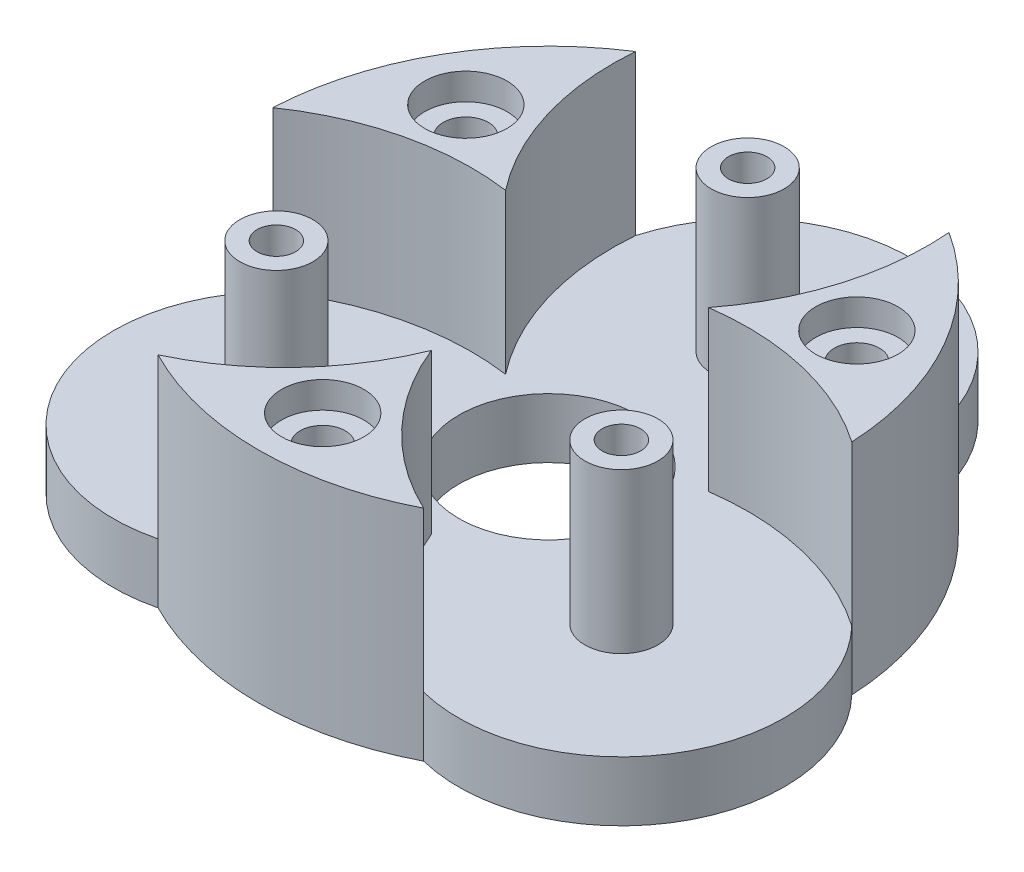
ISO-10303-21;
HEADER;
FILE_DESCRIPTION(('STEP AP214'),'2;1');
FILE_NAME('part.step','',(''),(''),'','','');
FILE_SCHEMA(('AUTOMOTIVE_DESIGN { 1 0 10303 214 1 1 1 1 }'));
ENDSEC;
DATA;
#1=APPLICATION_CONTEXT('core data for automotive mechanical design processes');
#2=APPLICATION_PROTOCOL_DEFINITION('international standard','automotive_design',2000,#1);
#3=PRODUCT_CONTEXT('',#1,'mechanical');
#4=PRODUCT('Part','Part','',(#3));
#5=PRODUCT_RELATED_PRODUCT_CATEGORY('part','',(#4));
#6=PRODUCT_DEFINITION_FORMATION('','',#4);
#7=PRODUCT_DEFINITION_CONTEXT('part definition',#1,'design');
#8=PRODUCT_DEFINITION('design','',#6,#7);
#9=PRODUCT_DEFINITION_SHAPE('','',#8);
#10=(LENGTH_UNIT() NAMED_UNIT(*) SI_UNIT(.MILLI.,.METRE.));
#11=(NAMED_UNIT(*) PLANE_ANGLE_UNIT() SI_UNIT($,.RADIAN.));
#12=(NAMED_UNIT(*) SI_UNIT($,.STERADIAN.) SOLID_ANGLE_UNIT());
#13=UNCERTAINTY_MEASURE_WITH_UNIT(LENGTH_MEASURE(1.E-05),#10,'distance_accuracy_value','');
#14=(GEOMETRIC_REPRESENTATION_CONTEXT(3) GLOBAL_UNCERTAINTY_ASSIGNED_CONTEXT((#13)) GLOBAL_UNIT_ASSIGNED_CONTEXT((#10,
#11,#12)) REPRESENTATION_CONTEXT('',''));
#15=CARTESIAN_POINT('',(0.,0.,0.));
#16=DIRECTION('',(0.,0.,1.));
#17=DIRECTION('',(1.,0.,0.));
#18=AXIS2_PLACEMENT_3D('',#15,#16,#17);
#19=CARTESIAN_POINT('',(-14.7224318643364,-4.80832611206852,-8.49999999999909));
#20=DIRECTION('',(0.,1.,0.));
#21=DIRECTION('',(0.,0.,1.));
#22=AXIS2_PLACEMENT_3D('',#19,#20,#21);
#23=CYLINDRICAL_SURFACE('',#22,1.7);
#24=CARTESIAN_POINT('',(-14.7224318643364,0.,-8.49999999999909));
#25=DIRECTION('',(0.,1.,0.));
#26=DIRECTION('',(0.,0.,1.));
#27=AXIS2_PLACEMENT_3D('',#24,#25,#26);
#28=CIRCLE('',#27,1.7);
#29=CARTESIAN_POINT('',(-14.7224318643364,0.,-6.79999999999909));
#30=VERTEX_POINT('',#29);
#31=EDGE_CURVE('E221',#30,#30,#28,.F.);
#32=ORIENTED_EDGE('',*,*,#31,.T.);
#33=EDGE_LOOP('',(#32));
#34=FACE_BOUND('',#33,.T.);
#35=CARTESIAN_POINT('',(-14.7224318643364,14.5,-8.49999999999909));
#36=DIRECTION('',(0.,1.,0.));
#37=DIRECTION('',(0.,0.,1.));
#38=AXIS2_PLACEMENT_3D('',#35,#36,#37);
#39=CIRCLE('',#38,1.7);
#40=CARTESIAN_POINT('',(-14.7224318643364,14.5,-6.79999999999909));
#41=VERTEX_POINT('',#40);
#42=EDGE_CURVE('E36',#41,#41,#39,.F.);
#43=ORIENTED_EDGE('',*,*,#42,.F.);
#44=EDGE_LOOP('',(#43));
#45=FACE_BOUND('',#44,.T.);
#46=ADVANCED_FACE('F32',(#34,#45),#23,.F.);
#47=CARTESIAN_POINT('',(14.7224318643351,-4.80832611206852,-8.50000000000133));
#48=DIRECTION('',(0.,1.,0.));
#49=DIRECTION('',(0.,0.,1.));
#50=AXIS2_PLACEMENT_3D('',#47,#48,#49);
#51=CYLINDRICAL_SURFACE('',#50,1.7);
#52=CARTESIAN_POINT('',(14.7224318643351,0.,-8.50000000000133));
#53=DIRECTION('',(0.,1.,0.));
#54=DIRECTION('',(0.,0.,1.));
#55=AXIS2_PLACEMENT_3D('',#52,#53,#54);
#56=CIRCLE('',#55,1.7);
#57=CARTESIAN_POINT('',(14.7224318643351,0.,-6.80000000000134));
#58=VERTEX_POINT('',#57);
#59=EDGE_CURVE('E179',#58,#58,#56,.F.);
#60=ORIENTED_EDGE('',*,*,#59,.T.);
#61=EDGE_LOOP('',(#60));
#62=FACE_BOUND('',#61,.T.);
#63=CARTESIAN_POINT('',(14.7224318643351,14.5,-8.50000000000133));
#64=DIRECTION('',(0.,1.,0.));
#65=DIRECTION('',(0.,0.,1.));
#66=AXIS2_PLACEMENT_3D('',#63,#64,#65);
#67=CIRCLE('',#66,1.7);
#68=CARTESIAN_POINT('',(14.7224318643351,14.5,-6.80000000000134));
#69=VERTEX_POINT('',#68);
#70=EDGE_CURVE('E285',#69,#69,#67,.F.);
#71=ORIENTED_EDGE('',*,*,#70,.F.);
#72=EDGE_LOOP('',(#71));
#73=FACE_BOUND('',#72,.T.);
#74=ADVANCED_FACE('F397',(#62,#73),#51,.F.);
#75=CARTESIAN_POINT('',(1.29150162786473E-12,-4.80832611206852,17.0000000000004));
#76=DIRECTION('',(0.,1.,0.));
#77=DIRECTION('',(0.,0.,1.));
#78=AXIS2_PLACEMENT_3D('',#75,#76,#77);
#79=CYLINDRICAL_SURFACE('',#78,1.7);
#80=CARTESIAN_POINT('',(1.29150162786473E-12,0.,17.0000000000004));
#81=DIRECTION('',(0.,1.,0.));
#82=DIRECTION('',(0.,0.,1.));
#83=AXIS2_PLACEMENT_3D('',#80,#81,#82);
#84=CIRCLE('',#83,1.7);
#85=CARTESIAN_POINT('',(1.29150162786473E-12,0.,18.7000000000004));
#86=VERTEX_POINT('',#85);
#87=EDGE_CURVE('E180',#86,#86,#84,.F.);
#88=ORIENTED_EDGE('',*,*,#87,.T.);
#89=EDGE_LOOP('',(#88));
#90=FACE_BOUND('',#89,.T.);
#91=CARTESIAN_POINT('',(1.29150162786473E-12,14.5,17.0000000000004));
#92=DIRECTION('',(0.,1.,0.));
#93=DIRECTION('',(0.,0.,1.));
#94=AXIS2_PLACEMENT_3D('',#91,#92,#93);
#95=CIRCLE('',#94,1.7);
#96=CARTESIAN_POINT('',(1.29150162786473E-12,14.5,18.7000000000004));
#97=VERTEX_POINT('',#96);
#98=EDGE_CURVE('E283',#97,#97,#95,.F.);
#99=ORIENTED_EDGE('',*,*,#98,.F.);
#100=EDGE_LOOP('',(#99));
#101=FACE_BOUND('',#100,.T.);
#102=ADVANCED_FACE('F403',(#90,#101),#79,.F.);
#103=CARTESIAN_POINT('',(0.,16.5,-15.));
#104=DIRECTION('',(0.,1.,0.));
#105=DIRECTION('',(0.,0.,1.));
#106=AXIS2_PLACEMENT_3D('',#103,#104,#105);
#107=CYLINDRICAL_SURFACE('',#106,1.45);
#108=CARTESIAN_POINT('',(0.,16.5,-15.));
#109=DIRECTION('',(0.,1.,0.));
#110=DIRECTION('',(0.,0.,1.));
#111=AXIS2_PLACEMENT_3D('',#108,#109,#110);
#112=CIRCLE('',#111,1.45);
#113=CARTESIAN_POINT('',(0.,16.5,-13.55));
#114=VERTEX_POINT('',#113);
#115=EDGE_CURVE('E176',#114,#114,#112,.T.);
#116=ORIENTED_EDGE('',*,*,#115,.T.);
#117=EDGE_LOOP('',(#116));
#118=FACE_BOUND('',#117,.T.);
#119=CARTESIAN_POINT('',(0.,2.2,-15.));
#120=DIRECTION('',(0.,-1.,0.));
#121=DIRECTION('',(0.,0.,-1.));
#122=AXIS2_PLACEMENT_3D('',#119,#120,#121);
#123=CIRCLE('',#122,1.45);
#124=CARTESIAN_POINT('',(0.,2.2,-16.45));
#125=VERTEX_POINT('',#124);
#126=EDGE_CURVE('E141',#125,#125,#123,.F.);
#127=ORIENTED_EDGE('',*,*,#126,.F.);
#128=EDGE_LOOP('',(#127));
#129=FACE_BOUND('',#128,.T.);
#130=ADVANCED_FACE('F477',(#118,#129),#107,.F.);
#131=CARTESIAN_POINT('',(-12.9903810567659,16.5,7.50000000000037));
#132=DIRECTION('',(0.,1.,0.));
#133=DIRECTION('',(0.,0.,1.));
#134=AXIS2_PLACEMENT_3D('',#131,#132,#133);
#135=CYLINDRICAL_SURFACE('',#134,1.45);
#136=CARTESIAN_POINT('',(-12.9903810567659,16.5,7.50000000000037));
#137=DIRECTION('',(0.,1.,0.));
#138=DIRECTION('',(0.,0.,1.));
#139=AXIS2_PLACEMENT_3D('',#136,#137,#138);
#140=CIRCLE('',#139,1.45);
#141=CARTESIAN_POINT('',(-12.9903810567659,16.5,8.95000000000037));
#142=VERTEX_POINT('',#141);
#143=EDGE_CURVE('E173',#142,#142,#140,.T.);
#144=ORIENTED_EDGE('',*,*,#143,.T.);
#145=EDGE_LOOP('',(#144));
#146=FACE_BOUND('',#145,.T.);
#147=CARTESIAN_POINT('',(-12.9903810567659,2.2,7.50000000000037));
#148=DIRECTION('',(0.,-1.,0.));
#149=DIRECTION('',(0.,0.,-1.));
#150=AXIS2_PLACEMENT_3D('',#147,#148,#149);
#151=CIRCLE('',#150,1.45);
#152=CARTESIAN_POINT('',(-12.9903810567659,2.2,6.05000000000038));
#153=VERTEX_POINT('',#152);
#154=EDGE_CURVE('E144',#153,#153,#151,.F.);
#155=ORIENTED_EDGE('',*,*,#154,.F.);
#156=EDGE_LOOP('',(#155));
#157=FACE_BOUND('',#156,.T.);
#158=ADVANCED_FACE('F532',(#146,#157),#135,.F.);
#159=CARTESIAN_POINT('',(12.9903810567672,16.5,7.49999999999963));
#160=DIRECTION('',(0.,1.,0.));
#161=DIRECTION('',(0.,0.,1.));
#162=AXIS2_PLACEMENT_3D('',#159,#160,#161);
#163=CYLINDRICAL_SURFACE('',#162,1.45);
#164=CARTESIAN_POINT('',(12.9903810567672,16.5,7.49999999999963));
#165=DIRECTION('',(0.,1.,0.));
#166=DIRECTION('',(0.,0.,1.));
#167=AXIS2_PLACEMENT_3D('',#164,#165,#166);
#168=CIRCLE('',#167,1.45);
#169=CARTESIAN_POINT('',(12.9903810567672,16.5,8.94999999999963));
#170=VERTEX_POINT('',#169);
#171=EDGE_CURVE('E170',#170,#170,#168,.T.);
#172=ORIENTED_EDGE('',*,*,#171,.T.);
#173=EDGE_LOOP('',(#172));
#174=FACE_BOUND('',#173,.T.);
#175=CARTESIAN_POINT('',(12.9903810567672,2.2,7.49999999999963));
#176=DIRECTION('',(0.,-1.,0.));
#177=DIRECTION('',(0.,0.,-1.));
#178=AXIS2_PLACEMENT_3D('',#175,#176,#177);
#179=CIRCLE('',#178,1.45);
#180=CARTESIAN_POINT('',(12.9903810567672,2.2,6.04999999999963));
#181=VERTEX_POINT('',#180);
#182=EDGE_CURVE('E277',#181,#181,#179,.F.);
#183=ORIENTED_EDGE('',*,*,#182,.F.);
#184=EDGE_LOOP('',(#183));
#185=FACE_BOUND('',#184,.T.);
#186=ADVANCED_FACE('F529',(#174,#185),#163,.F.);
#187=CARTESIAN_POINT('',(0.,4.5,0.));
#188=DIRECTION('',(0.,-1.,0.));
#189=DIRECTION('',(0.,0.,-1.));
#190=AXIS2_PLACEMENT_3D('',#187,#188,#189);
#191=CYLINDRICAL_SURFACE('',#190,21.825);
#192=CARTESIAN_POINT('',(0.,0.,0.));
#193=DIRECTION('',(0.,1.,0.));
#194=DIRECTION('',(0.,0.,1.));
#195=AXIS2_PLACEMENT_3D('',#192,#193,#194);
#196=CIRCLE('',#195,21.825);
#197=CARTESIAN_POINT('',(21.8002371635045,0.,-1.03936741095642));
#198=VERTEX_POINT('',#197);
#199=CARTESIAN_POINT('',(11.8002371635036,0.,-18.3598754866439));
#200=VERTEX_POINT('',#199);
#201=EDGE_CURVE('E41',#198,#200,#196,.T.);
#202=ORIENTED_EDGE('',*,*,#201,.T.);
#203=DIRECTION('',(0.,-1.,0.));
#204=VECTOR('',#203,1.);
#205=CARTESIAN_POINT('',(11.8002371635029,29.7261619064555,-18.3598754866443));
#206=LINE('',#205,#204);
#207=CARTESIAN_POINT('',(11.800237163503,4.5,-18.3598754866443));
#208=VERTEX_POINT('',#207);
#209=EDGE_CURVE('E140',#208,#200,#206,.T.);
#210=ORIENTED_EDGE('',*,*,#209,.F.);
#211=DIRECTION('',(0.,-1.,0.));
#212=VECTOR('',#211,1.);
#213=CARTESIAN_POINT('',(11.800237163503,38.8704400804743,-18.3598754866443));
#214=LINE('',#213,#212);
#215=CARTESIAN_POINT('',(11.800237163503,16.5,-18.3598754866443));
#216=VERTEX_POINT('',#215);
#217=EDGE_CURVE('E194',#216,#208,#214,.T.);
#218=ORIENTED_EDGE('',*,*,#217,.F.);
#219=CARTESIAN_POINT('',(0.,16.5,0.));
#220=DIRECTION('',(0.,1.,0.));
#221=DIRECTION('',(0.,0.,1.));
#222=AXIS2_PLACEMENT_3D('',#219,#220,#221);
#223=CIRCLE('',#222,21.825);
#224=CARTESIAN_POINT('',(21.8002371635045,16.5,-1.03936741095635));
#225=VERTEX_POINT('',#224);
#226=EDGE_CURVE('E199',#225,#216,#223,.T.);
#227=ORIENTED_EDGE('',*,*,#226,.F.);
#228=DIRECTION('',(0.,-1.,0.));
#229=VECTOR('',#228,1.);
#230=CARTESIAN_POINT('',(21.8002371635045,38.8704400804743,-1.03936741095636));
#231=LINE('',#230,#229);
#232=CARTESIAN_POINT('',(21.8002371635045,4.5,-1.03936741095635));
#233=VERTEX_POINT('',#232);
#234=EDGE_CURVE('E183',#225,#233,#231,.T.);
#235=ORIENTED_EDGE('',*,*,#234,.T.);
#236=DIRECTION('',(0.,-1.,0.));
#237=VECTOR('',#236,1.);
#238=CARTESIAN_POINT('',(21.8002371635045,30.3041566652598,-1.03936741095642));
#239=LINE('',#238,#237);
#240=EDGE_CURVE('E155',#233,#198,#239,.T.);
#241=ORIENTED_EDGE('',*,*,#240,.T.);
#242=EDGE_LOOP('',(#202,#210,#218,#227,#235,#241));
#243=FACE_BOUND('',#242,.T.);
#244=ADVANCED_FACE('F380',(#243),#191,.T.);
#245=CARTESIAN_POINT('',(-9.99999999999841,0.,19.3992428975987));
#246=VERTEX_POINT('',#245);
#247=CARTESIAN_POINT('',(10.0000000000009,0.,19.3992428975974));
#248=VERTEX_POINT('',#247);
#249=EDGE_CURVE('E11',#246,#248,#196,.T.);
#250=ORIENTED_EDGE('',*,*,#249,.T.);
#251=DIRECTION('',(0.,-1.,0.));
#252=VECTOR('',#251,1.);
#253=CARTESIAN_POINT('',(10.0000000000016,30.3041566652598,19.399242897597));
#254=LINE('',#253,#252);
#255=CARTESIAN_POINT('',(10.0000000000016,4.5,19.399242897597));
#256=VERTEX_POINT('',#255);
#257=EDGE_CURVE('E159',#256,#248,#254,.T.);
#258=ORIENTED_EDGE('',*,*,#257,.F.);
#259=DIRECTION('',(0.,-1.,0.));
#260=VECTOR('',#259,1.);
#261=CARTESIAN_POINT('',(10.0000000000016,40.3537208837531,19.399242897597));
#262=LINE('',#261,#260);
#263=CARTESIAN_POINT('',(10.0000000000016,16.5,19.399242897597));
#264=VERTEX_POINT('',#263);
#265=EDGE_CURVE('E217',#264,#256,#262,.T.);
#266=ORIENTED_EDGE('',*,*,#265,.F.);
#267=CARTESIAN_POINT('',(0.,16.5,0.));
#268=DIRECTION('',(0.,1.,0.));
#269=DIRECTION('',(0.,0.,1.));
#270=AXIS2_PLACEMENT_3D('',#267,#268,#269);
#271=CIRCLE('',#270,21.825);
#272=CARTESIAN_POINT('',(-9.99999999999842,16.5,19.3992428975986));
#273=VERTEX_POINT('',#272);
#274=EDGE_CURVE('E222',#273,#264,#271,.T.);
#275=ORIENTED_EDGE('',*,*,#274,.F.);
#276=DIRECTION('',(0.,-1.,0.));
#277=VECTOR('',#276,1.);
#278=CARTESIAN_POINT('',(-9.99999999999842,40.3537208837531,19.3992428975987));
#279=LINE('',#278,#277);
#280=CARTESIAN_POINT('',(-9.99999999999842,4.5,19.3992428975987));
#281=VERTEX_POINT('',#280);
#282=EDGE_CURVE('E198',#273,#281,#279,.T.);
#283=ORIENTED_EDGE('',*,*,#282,.T.);
#284=DIRECTION('',(0.,-1.,0.));
#285=VECTOR('',#284,1.);
#286=CARTESIAN_POINT('',(-9.99999999999841,30.3041566652593,19.3992428975987));
#287=LINE('',#286,#285);
#288=EDGE_CURVE('E163',#281,#246,#287,.T.);
#289=ORIENTED_EDGE('',*,*,#288,.T.);
#290=EDGE_LOOP('',(#250,#258,#266,#275,#283,#289));
#291=FACE_BOUND('',#290,.T.);
#292=ADVANCED_FACE('F351',(#291),#191,.T.);
#293=CARTESIAN_POINT('',(0.,4.5,0.));
#294=DIRECTION('',(0.,1.,0.));
#295=DIRECTION('',(0.,0.,1.));
#296=AXIS2_PLACEMENT_3D('',#293,#294,#295);
#297=PLANE('',#296);
#298=CARTESIAN_POINT('',(0.,4.5,0.));
#299=DIRECTION('',(0.,1.,0.));
#300=DIRECTION('',(0.,0.,1.));
#301=AXIS2_PLACEMENT_3D('',#298,#299,#300);
#302=CIRCLE('',#301,6.75);
#303=CARTESIAN_POINT('',(0.,4.5,6.75));
#304=VERTEX_POINT('',#303);
#305=EDGE_CURVE('E244',#304,#304,#302,.T.);
#306=ORIENTED_EDGE('',*,*,#305,.F.);
#307=EDGE_LOOP('',(#306));
#308=FACE_BOUND('',#307,.T.);
#309=CARTESIAN_POINT('',(-12.9903810567659,4.5,7.50000000000037));
#310=DIRECTION('',(0.,1.,0.));
#311=DIRECTION('',(0.,0.,1.));
#312=AXIS2_PLACEMENT_3D('',#309,#310,#311);
#313=CIRCLE('',#312,2.75);
#314=CARTESIAN_POINT('',(-12.9903810567659,4.5,10.2500000000004));
#315=VERTEX_POINT('',#314);
#316=EDGE_CURVE('E260',#315,#315,#313,.T.);
#317=ORIENTED_EDGE('',*,*,#316,.F.);
#318=EDGE_LOOP('',(#317));
#319=FACE_BOUND('',#318,.T.);
#320=CARTESIAN_POINT('',(12.9903810567672,4.5,7.49999999999963));
#321=DIRECTION('',(0.,1.,0.));
#322=DIRECTION('',(0.,0.,1.));
#323=AXIS2_PLACEMENT_3D('',#320,#321,#322);
#324=CIRCLE('',#323,2.75);
#325=CARTESIAN_POINT('',(12.9903810567672,4.5,10.2499999999996));
#326=VERTEX_POINT('',#325);
#327=EDGE_CURVE('E264',#326,#326,#324,.T.);
#328=ORIENTED_EDGE('',*,*,#327,.F.);
#329=EDGE_LOOP('',(#328));
#330=FACE_BOUND('',#329,.T.);
#331=CARTESIAN_POINT('',(0.,4.5,-15.));
#332=DIRECTION('',(0.,1.,0.));
#333=DIRECTION('',(0.,0.,1.));
#334=AXIS2_PLACEMENT_3D('',#331,#332,#333);
#335=CIRCLE('',#334,2.75);
#336=CARTESIAN_POINT('',(0.,4.5,-12.25));
#337=VERTEX_POINT('',#336);
#338=EDGE_CURVE('E270',#337,#337,#335,.T.);
#339=ORIENTED_EDGE('',*,*,#338,.F.);
#340=EDGE_LOOP('',(#339));
#341=FACE_BOUND('',#340,.T.);
#342=CARTESIAN_POINT('',(10.4048257460099,4.5,15.3916345964232));
#343=DIRECTION('',(0.,-1.,0.));
#344=DIRECTION('',(0.866025403784441,0.,0.499999999999997));
#345=AXIS2_PLACEMENT_3D('',#342,#343,#344);
#346=CIRCLE('',#345,19.9958302738465);
#347=CARTESIAN_POINT('',(7.64267418839752,4.5,-4.41250000000025));
#348=VERTEX_POINT('',#347);
#349=EDGE_CURVE('E186',#348,#233,#346,.T.);
#350=ORIENTED_EDGE('',*,*,#349,.F.);
#351=CARTESIAN_POINT('',(-8.12713369326764,4.5,-16.706660716204));
#352=DIRECTION('',(0.,-1.,0.));
#353=DIRECTION('',(-0.866025403784441,0.,-0.499999999999997));
#354=AXIS2_PLACEMENT_3D('',#351,#352,#353);
#355=CIRCLE('',#354,19.9958302738465);
#356=EDGE_CURVE('E191',#208,#348,#355,.T.);
#357=ORIENTED_EDGE('',*,*,#356,.F.);
#358=CARTESIAN_POINT('',(-7.84095011141517E-13,4.5,-14.9999999999996));
#359=DIRECTION('',(0.,1.,0.));
#360=DIRECTION('',(0.,0.,1.));
#361=AXIS2_PLACEMENT_3D('',#358,#359,#360);
#362=CIRCLE('',#361,12.2692444918464);
#363=CARTESIAN_POINT('',(-11.800237163506,4.5,-18.3598754866424));
#364=VERTEX_POINT('',#363);
#365=EDGE_CURVE('E137',#364,#208,#362,.F.);
#366=ORIENTED_EDGE('',*,*,#365,.F.);
#367=CARTESIAN_POINT('',(8.12713369326501,4.5,-16.7066607162065));
#368=DIRECTION('',(0.,-1.,0.));
#369=DIRECTION('',(0.,0.,-1.));
#370=AXIS2_PLACEMENT_3D('',#367,#368,#369);
#371=CIRCLE('',#370,19.9958302738465);
#372=CARTESIAN_POINT('',(-7.64267418839779,4.5,-4.41249999999977));
#373=VERTEX_POINT('',#372);
#374=EDGE_CURVE('E234',#373,#364,#371,.T.);
#375=ORIENTED_EDGE('',*,*,#374,.F.);
#376=CARTESIAN_POINT('',(-10.4048257460064,4.5,15.3916345964242));
#377=DIRECTION('',(0.,-1.,0.));
#378=DIRECTION('',(0.,0.,1.));
#379=AXIS2_PLACEMENT_3D('',#376,#377,#378);
#380=CIRCLE('',#379,19.9958302738465);
#381=CARTESIAN_POINT('',(-21.8002371635047,4.5,-1.0393674109528));
#382=VERTEX_POINT('',#381);
#383=EDGE_CURVE('E238',#382,#373,#380,.T.);
#384=ORIENTED_EDGE('',*,*,#383,.F.);
#385=CARTESIAN_POINT('',(-12.9903810567659,4.5,7.50000000000037));
#386=DIRECTION('',(0.,1.,0.));
#387=DIRECTION('',(0.,0.,1.));
#388=AXIS2_PLACEMENT_3D('',#385,#386,#387);
#389=CIRCLE('',#388,12.2692444918464);
#390=EDGE_CURVE('E164',#281,#382,#389,.F.);
#391=ORIENTED_EDGE('',*,*,#390,.F.);
#392=CARTESIAN_POINT('',(-18.5319594392749,4.5,1.31502611978334));
#393=DIRECTION('',(0.,-1.,0.));
#394=DIRECTION('',(-0.866025403784438,0.,0.500000000000002));
#395=AXIS2_PLACEMENT_3D('',#392,#393,#394);
#396=CIRCLE('',#395,19.9958302738465);
#397=CARTESIAN_POINT('',(2.74086309204336E-13,4.5,8.825));
#398=VERTEX_POINT('',#397);
#399=EDGE_CURVE('E209',#398,#281,#396,.T.);
#400=ORIENTED_EDGE('',*,*,#399,.F.);
#401=CARTESIAN_POINT('',(18.531959439274,4.5,1.3150261197798));
#402=DIRECTION('',(0.,-1.,0.));
#403=DIRECTION('',(0.866025403784438,0.,-0.500000000000002));
#404=AXIS2_PLACEMENT_3D('',#401,#402,#403);
#405=CIRCLE('',#404,19.9958302738465);
#406=EDGE_CURVE('E214',#256,#398,#405,.T.);
#407=ORIENTED_EDGE('',*,*,#406,.F.);
#408=CARTESIAN_POINT('',(12.9903810567666,4.5,7.4999999999992));
#409=DIRECTION('',(0.,1.,0.));
#410=DIRECTION('',(0.,0.,1.));
#411=AXIS2_PLACEMENT_3D('',#408,#409,#410);
#412=CIRCLE('',#411,12.2692444918464);
#413=EDGE_CURVE('E156',#233,#256,#412,.F.);
#414=ORIENTED_EDGE('',*,*,#413,.F.);
#415=EDGE_LOOP('',(#350,#357,#366,#375,#384,#391,#400,#407,#414));
#416=FACE_BOUND('',#415,.T.);
#417=ADVANCED_FACE('F361',(#308,#319,#330,#341,#416),#297,.T.);
#418=DIRECTION('',(0.,-1.,0.));
#419=VECTOR('',#418,1.);
#420=CARTESIAN_POINT('',(-11.800237163506,38.8704400804755,-18.3598754866424));
#421=LINE('',#420,#419);
#422=CARTESIAN_POINT('',(-11.800237163506,16.5,-18.3598754866424));
#423=VERTEX_POINT('',#422);
#424=EDGE_CURVE('E133',#423,#364,#421,.T.);
#425=ORIENTED_EDGE('',*,*,#424,.T.);
#426=DIRECTION('',(0.,-1.,0.));
#427=VECTOR('',#426,1.);
#428=CARTESIAN_POINT('',(-11.8002371635062,29.7261619064555,-18.3598754866422));
#429=LINE('',#428,#427);
#430=CARTESIAN_POINT('',(-11.8002371635062,0.,-18.3598754866422));
#431=VERTEX_POINT('',#430);
#432=EDGE_CURVE('E131',#364,#431,#429,.T.);
#433=ORIENTED_EDGE('',*,*,#432,.T.);
#434=CARTESIAN_POINT('',(-21.8002371635046,0.,-1.03936741095362));
#435=VERTEX_POINT('',#434);
#436=EDGE_CURVE('E43',#431,#435,#196,.T.);
#437=ORIENTED_EDGE('',*,*,#436,.T.);
#438=DIRECTION('',(0.,-1.,0.));
#439=VECTOR('',#438,1.);
#440=CARTESIAN_POINT('',(-21.8002371635047,30.3041566652593,-1.0393674109528));
#441=LINE('',#440,#439);
#442=EDGE_CURVE('E167',#382,#435,#441,.T.);
#443=ORIENTED_EDGE('',*,*,#442,.F.);
#444=DIRECTION('',(0.,-1.,0.));
#445=VECTOR('',#444,1.);
#446=CARTESIAN_POINT('',(-21.8002371635047,38.8704400804755,-1.0393674109528));
#447=LINE('',#446,#445);
#448=CARTESIAN_POINT('',(-21.8002371635047,16.5,-1.0393674109528));
#449=VERTEX_POINT('',#448);
#450=EDGE_CURVE('E240',#449,#382,#447,.T.);
#451=ORIENTED_EDGE('',*,*,#450,.F.);
#452=CARTESIAN_POINT('',(0.,16.5,0.));
#453=DIRECTION('',(0.,1.,0.));
#454=DIRECTION('',(0.,0.,1.));
#455=AXIS2_PLACEMENT_3D('',#452,#453,#454);
#456=CIRCLE('',#455,21.825);
#457=EDGE_CURVE('E245',#423,#449,#456,.T.);
#458=ORIENTED_EDGE('',*,*,#457,.F.);
#459=EDGE_LOOP('',(#425,#433,#437,#443,#451,#458));
#460=FACE_BOUND('',#459,.T.);
#461=ADVANCED_FACE('F34',(#460),#191,.T.);
#462=CARTESIAN_POINT('',(0.,0.,0.));
#463=DIRECTION('',(0.,1.,0.));
#464=DIRECTION('',(0.,0.,1.));
#465=AXIS2_PLACEMENT_3D('',#462,#463,#464);
#466=PLANE('',#465);
#467=CARTESIAN_POINT('',(-12.9903810567659,0.,7.50000000000037));
#468=DIRECTION('',(0.,-1.,0.));
#469=DIRECTION('',(0.,0.,-1.));
#470=AXIS2_PLACEMENT_3D('',#467,#468,#469);
#471=CIRCLE('',#470,2.875);
#472=CARTESIAN_POINT('',(-12.9903810567659,0.,4.62500000000037));
#473=VERTEX_POINT('',#472);
#474=EDGE_CURVE('E307',#473,#473,#471,.T.);
#475=ORIENTED_EDGE('',*,*,#474,.F.);
#476=EDGE_LOOP('',(#475));
#477=FACE_BOUND('',#476,.T.);
#478=CARTESIAN_POINT('',(12.9903810567666,0.,7.50000000000037));
#479=DIRECTION('',(0.,-1.,0.));
#480=DIRECTION('',(0.,0.,-1.));
#481=AXIS2_PLACEMENT_3D('',#478,#479,#480);
#482=CIRCLE('',#481,2.87500000000113);
#483=CARTESIAN_POINT('',(12.9903810567666,0.,4.62499999999924));
#484=VERTEX_POINT('',#483);
#485=EDGE_CURVE('E298',#484,#484,#482,.T.);
#486=ORIENTED_EDGE('',*,*,#485,.F.);
#487=EDGE_LOOP('',(#486));
#488=FACE_BOUND('',#487,.T.);
#489=CARTESIAN_POINT('',(3.19241253223778E-13,0.,-14.9999999999991));
#490=DIRECTION('',(0.,-1.,0.));
#491=DIRECTION('',(0.,0.,-1.));
#492=AXIS2_PLACEMENT_3D('',#489,#490,#491);
#493=CIRCLE('',#492,2.87500000000044);
#494=CARTESIAN_POINT('',(3.19241253223778E-13,0.,-17.8749999999995));
#495=VERTEX_POINT('',#494);
#496=EDGE_CURVE('E148',#495,#495,#493,.T.);
#497=ORIENTED_EDGE('',*,*,#496,.F.);
#498=EDGE_LOOP('',(#497));
#499=FACE_BOUND('',#498,.T.);
#500=ORIENTED_EDGE('',*,*,#87,.F.);
#501=EDGE_LOOP('',(#500));
#502=FACE_BOUND('',#501,.T.);
#503=ORIENTED_EDGE('',*,*,#59,.F.);
#504=EDGE_LOOP('',(#503));
#505=FACE_BOUND('',#504,.T.);
#506=ORIENTED_EDGE('',*,*,#31,.F.);
#507=EDGE_LOOP('',(#506));
#508=FACE_BOUND('',#507,.T.);
#509=CARTESIAN_POINT('',(0.,0.,0.));
#510=DIRECTION('',(0.,1.,0.));
#511=DIRECTION('',(0.,0.,1.));
#512=AXIS2_PLACEMENT_3D('',#509,#510,#511);
#513=CIRCLE('',#512,6.75);
#514=CARTESIAN_POINT('',(0.,0.,6.75));
#515=VERTEX_POINT('',#514);
#516=EDGE_CURVE('E257',#515,#515,#513,.T.);
#517=ORIENTED_EDGE('',*,*,#516,.T.);
#518=EDGE_LOOP('',(#517));
#519=FACE_BOUND('',#518,.T.);
#520=ORIENTED_EDGE('',*,*,#249,.F.);
#521=CARTESIAN_POINT('',(-12.9903810567659,0.,7.50000000000037));
#522=DIRECTION('',(0.,-1.,0.));
#523=DIRECTION('',(0.,0.,1.));
#524=AXIS2_PLACEMENT_3D('',#521,#522,#523);
#525=CIRCLE('',#524,12.2692444918464);
#526=EDGE_CURVE('E126',#246,#435,#525,.T.);
#527=ORIENTED_EDGE('',*,*,#526,.T.);
#528=ORIENTED_EDGE('',*,*,#436,.F.);
#529=CARTESIAN_POINT('',(-7.84095011141517E-13,0.,-14.9999999999996));
#530=DIRECTION('',(0.,-1.,0.));
#531=DIRECTION('',(-0.866025403784443,0.,-0.499999999999992));
#532=AXIS2_PLACEMENT_3D('',#529,#530,#531);
#533=CIRCLE('',#532,12.2692444918464);
#534=EDGE_CURVE('E124',#431,#200,#533,.T.);
#535=ORIENTED_EDGE('',*,*,#534,.T.);
#536=ORIENTED_EDGE('',*,*,#201,.F.);
#537=CARTESIAN_POINT('',(12.9903810567666,0.,7.4999999999992));
#538=DIRECTION('',(0.,-1.,0.));
#539=DIRECTION('',(0.866025403784436,0.,-0.500000000000004));
#540=AXIS2_PLACEMENT_3D('',#537,#538,#539);
#541=CIRCLE('',#540,12.2692444918464);
#542=EDGE_CURVE('E152',#198,#248,#541,.T.);
#543=ORIENTED_EDGE('',*,*,#542,.T.);
#544=EDGE_LOOP('',(#520,#527,#528,#535,#536,#543));
#545=FACE_BOUND('',#544,.T.);
#546=ADVANCED_FACE('F122',(#477,#488,#499,#502,#505,#508,#519,#545),#466,.F.);
#547=CARTESIAN_POINT('',(0.,16.5,-15.));
#548=DIRECTION('',(0.,-1.,0.));
#549=DIRECTION('',(0.,0.,-1.));
#550=AXIS2_PLACEMENT_3D('',#547,#548,#549);
#551=CYLINDRICAL_SURFACE('',#550,2.75);
#552=CARTESIAN_POINT('',(0.,16.5,-15.));
#553=DIRECTION('',(0.,1.,0.));
#554=DIRECTION('',(0.,0.,1.));
#555=AXIS2_PLACEMENT_3D('',#552,#553,#554);
#556=CIRCLE('',#555,2.75);
#557=CARTESIAN_POINT('',(0.,16.5,-12.25));
#558=VERTEX_POINT('',#557);
#559=EDGE_CURVE('E129',#558,#558,#556,.T.);
#560=ORIENTED_EDGE('',*,*,#559,.F.);
#561=EDGE_LOOP('',(#560));
#562=FACE_BOUND('',#561,.T.);
#563=ORIENTED_EDGE('',*,*,#338,.T.);
#564=EDGE_LOOP('',(#563));
#565=FACE_BOUND('',#564,.T.);
#566=ADVANCED_FACE('F438',(#562,#565),#551,.T.);
#567=CARTESIAN_POINT('',(0.,16.5,-15.));
#568=DIRECTION('',(0.,1.,0.));
#569=DIRECTION('',(0.,0.,1.));
#570=AXIS2_PLACEMENT_3D('',#567,#568,#569);
#571=PLANE('',#570);
#572=ORIENTED_EDGE('',*,*,#115,.F.);
#573=EDGE_LOOP('',(#572));
#574=FACE_BOUND('',#573,.T.);
#575=ORIENTED_EDGE('',*,*,#559,.T.);
#576=EDGE_LOOP('',(#575));
#577=FACE_BOUND('',#576,.T.);
#578=ADVANCED_FACE('F434',(#574,#577),#571,.T.);
#579=CARTESIAN_POINT('',(12.9903810567672,16.5,7.49999999999963));
#580=DIRECTION('',(0.,-1.,0.));
#581=DIRECTION('',(0.,0.,-1.));
#582=AXIS2_PLACEMENT_3D('',#579,#580,#581);
#583=CYLINDRICAL_SURFACE('',#582,2.75);
#584=CARTESIAN_POINT('',(12.9903810567672,16.5,7.49999999999963));
#585=DIRECTION('',(0.,1.,0.));
#586=DIRECTION('',(0.,0.,1.));
#587=AXIS2_PLACEMENT_3D('',#584,#585,#586);
#588=CIRCLE('',#587,2.75);
#589=CARTESIAN_POINT('',(12.9903810567672,16.5,10.2499999999996));
#590=VERTEX_POINT('',#589);
#591=EDGE_CURVE('E267',#590,#590,#588,.T.);
#592=ORIENTED_EDGE('',*,*,#591,.F.);
#593=EDGE_LOOP('',(#592));
#594=FACE_BOUND('',#593,.T.);
#595=ORIENTED_EDGE('',*,*,#327,.T.);
#596=EDGE_LOOP('',(#595));
#597=FACE_BOUND('',#596,.T.);
#598=ADVANCED_FACE('F430',(#594,#597),#583,.T.);
#599=CARTESIAN_POINT('',(12.9903810567672,16.5,7.49999999999963));
#600=DIRECTION('',(0.,1.,0.));
#601=DIRECTION('',(0.,0.,1.));
#602=AXIS2_PLACEMENT_3D('',#599,#600,#601);
#603=PLANE('',#602);
#604=ORIENTED_EDGE('',*,*,#171,.F.);
#605=EDGE_LOOP('',(#604));
#606=FACE_BOUND('',#605,.T.);
#607=ORIENTED_EDGE('',*,*,#591,.T.);
#608=EDGE_LOOP('',(#607));
#609=FACE_BOUND('',#608,.T.);
#610=ADVANCED_FACE('F426',(#606,#609),#603,.T.);
#611=CARTESIAN_POINT('',(-12.9903810567659,16.5,7.50000000000037));
#612=DIRECTION('',(0.,-1.,0.));
#613=DIRECTION('',(0.,0.,-1.));
#614=AXIS2_PLACEMENT_3D('',#611,#612,#613);
#615=CYLINDRICAL_SURFACE('',#614,2.75);
#616=CARTESIAN_POINT('',(-12.9903810567659,16.5,7.50000000000037));
#617=DIRECTION('',(0.,1.,0.));
#618=DIRECTION('',(0.,0.,1.));
#619=AXIS2_PLACEMENT_3D('',#616,#617,#618);
#620=CIRCLE('',#619,2.75);
#621=CARTESIAN_POINT('',(-12.9903810567659,16.5,10.2500000000004));
#622=VERTEX_POINT('',#621);
#623=EDGE_CURVE('E261',#622,#622,#620,.T.);
#624=ORIENTED_EDGE('',*,*,#623,.F.);
#625=EDGE_LOOP('',(#624));
#626=FACE_BOUND('',#625,.T.);
#627=ORIENTED_EDGE('',*,*,#316,.T.);
#628=EDGE_LOOP('',(#627));
#629=FACE_BOUND('',#628,.T.);
#630=ADVANCED_FACE('F422',(#626,#629),#615,.T.);
#631=CARTESIAN_POINT('',(-12.9903810567659,16.5,7.50000000000037));
#632=DIRECTION('',(0.,1.,0.));
#633=DIRECTION('',(0.,0.,1.));
#634=AXIS2_PLACEMENT_3D('',#631,#632,#633);
#635=PLANE('',#634);
#636=ORIENTED_EDGE('',*,*,#143,.F.);
#637=EDGE_LOOP('',(#636));
#638=FACE_BOUND('',#637,.T.);
#639=ORIENTED_EDGE('',*,*,#623,.T.);
#640=EDGE_LOOP('',(#639));
#641=FACE_BOUND('',#640,.T.);
#642=ADVANCED_FACE('F418',(#638,#641),#635,.T.);
#643=CARTESIAN_POINT('',(0.,4.5,0.));
#644=DIRECTION('',(0.,1.,0.));
#645=DIRECTION('',(0.,0.,1.));
#646=AXIS2_PLACEMENT_3D('',#643,#644,#645);
#647=CYLINDRICAL_SURFACE('',#646,6.75);
#648=ORIENTED_EDGE('',*,*,#516,.F.);
#649=EDGE_LOOP('',(#648));
#650=FACE_BOUND('',#649,.T.);
#651=ORIENTED_EDGE('',*,*,#305,.T.);
#652=EDGE_LOOP('',(#651));
#653=FACE_BOUND('',#652,.T.);
#654=ADVANCED_FACE('F412',(#650,#653),#647,.F.);
#655=CARTESIAN_POINT('',(-10.4048257460064,38.8704400804755,15.3916345964242));
#656=DIRECTION('',(0.,-1.,0.));
#657=DIRECTION('',(0.,0.,-1.));
#658=AXIS2_PLACEMENT_3D('',#655,#656,#657);
#659=CYLINDRICAL_SURFACE('',#658,19.9958302738465);
#660=CARTESIAN_POINT('',(-10.4048257460064,16.5,15.3916345964242));
#661=DIRECTION('',(0.,1.,0.));
#662=DIRECTION('',(0.,0.,1.));
#663=AXIS2_PLACEMENT_3D('',#660,#661,#662);
#664=CIRCLE('',#663,19.9958302738465);
#665=CARTESIAN_POINT('',(-7.64267418839779,16.5,-4.41249999999977));
#666=VERTEX_POINT('',#665);
#667=EDGE_CURVE('E241',#449,#666,#664,.F.);
#668=ORIENTED_EDGE('',*,*,#667,.F.);
#669=ORIENTED_EDGE('',*,*,#450,.T.);
#670=ORIENTED_EDGE('',*,*,#383,.T.);
#671=DIRECTION('',(0.,-1.,0.));
#672=VECTOR('',#671,1.);
#673=CARTESIAN_POINT('',(-7.64267418839779,38.8704400804755,-4.41249999999977));
#674=LINE('',#673,#672);
#675=EDGE_CURVE('E237',#666,#373,#674,.T.);
#676=ORIENTED_EDGE('',*,*,#675,.F.);
#677=EDGE_LOOP('',(#668,#669,#670,#676));
#678=FACE_BOUND('',#677,.T.);
#679=ADVANCED_FACE('F370',(#678),#659,.F.);
#680=CARTESIAN_POINT('',(8.12713369326501,38.8704400804755,-16.7066607162065));
#681=DIRECTION('',(0.,-1.,0.));
#682=DIRECTION('',(0.,0.,-1.));
#683=AXIS2_PLACEMENT_3D('',#680,#681,#682);
#684=CYLINDRICAL_SURFACE('',#683,19.9958302738465);
#685=CARTESIAN_POINT('',(8.12713369326501,16.5,-16.7066607162065));
#686=DIRECTION('',(0.,1.,0.));
#687=DIRECTION('',(0.,0.,1.));
#688=AXIS2_PLACEMENT_3D('',#685,#686,#687);
#689=CIRCLE('',#688,19.9958302738465);
#690=EDGE_CURVE('E236',#666,#423,#689,.F.);
#691=ORIENTED_EDGE('',*,*,#690,.F.);
#692=ORIENTED_EDGE('',*,*,#675,.T.);
#693=ORIENTED_EDGE('',*,*,#374,.T.);
#694=ORIENTED_EDGE('',*,*,#424,.F.);
#695=EDGE_LOOP('',(#691,#692,#693,#694));
#696=FACE_BOUND('',#695,.T.);
#697=ADVANCED_FACE('F375',(#696),#684,.F.);
#698=CARTESIAN_POINT('',(-12.9903810567659,16.5,7.50000000000037));
#699=DIRECTION('',(0.,1.,0.));
#700=DIRECTION('',(0.,0.,1.));
#701=AXIS2_PLACEMENT_3D('',#698,#699,#700);
#702=PLANE('',#701);
#703=CARTESIAN_POINT('',(-14.7224318643364,16.5,-8.49999999999913));
#704=DIRECTION('',(0.,1.,0.));
#705=DIRECTION('',(0.,0.,1.));
#706=AXIS2_PLACEMENT_3D('',#703,#704,#705);
#707=CIRCLE('',#706,3.1);
#708=CARTESIAN_POINT('',(-14.7224318643364,16.5,-5.39999999999914));
#709=VERTEX_POINT('',#708);
#710=EDGE_CURVE('E318',#709,#709,#707,.T.);
#711=ORIENTED_EDGE('',*,*,#710,.F.);
#712=EDGE_LOOP('',(#711));
#713=FACE_BOUND('',#712,.T.);
#714=ORIENTED_EDGE('',*,*,#690,.T.);
#715=ORIENTED_EDGE('',*,*,#457,.T.);
#716=ORIENTED_EDGE('',*,*,#667,.T.);
#717=EDGE_LOOP('',(#714,#715,#716));
#718=FACE_BOUND('',#717,.T.);
#719=ADVANCED_FACE('F373',(#713,#718),#702,.T.);
#720=CARTESIAN_POINT('',(18.531959439274,40.3537208837531,1.3150261197798));
#721=DIRECTION('',(0.,-1.,0.));
#722=DIRECTION('',(0.,0.,-1.));
#723=AXIS2_PLACEMENT_3D('',#720,#721,#722);
#724=CYLINDRICAL_SURFACE('',#723,19.9958302738465);
#725=CARTESIAN_POINT('',(18.531959439274,16.5,1.3150261197798));
#726=DIRECTION('',(0.,1.,0.));
#727=DIRECTION('',(0.,0.,1.));
#728=AXIS2_PLACEMENT_3D('',#725,#726,#727);
#729=CIRCLE('',#728,19.9958302738465);
#730=CARTESIAN_POINT('',(2.74086309204336E-13,16.5,8.825));
#731=VERTEX_POINT('',#730);
#732=EDGE_CURVE('E218',#264,#731,#729,.F.);
#733=ORIENTED_EDGE('',*,*,#732,.F.);
#734=ORIENTED_EDGE('',*,*,#265,.T.);
#735=ORIENTED_EDGE('',*,*,#406,.T.);
#736=DIRECTION('',(0.,-1.,0.));
#737=VECTOR('',#736,1.);
#738=CARTESIAN_POINT('',(2.74086309204336E-13,40.3537208837531,8.825));
#739=LINE('',#738,#737);
#740=EDGE_CURVE('E213',#731,#398,#739,.T.);
#741=ORIENTED_EDGE('',*,*,#740,.F.);
#742=EDGE_LOOP('',(#733,#734,#735,#741));
#743=FACE_BOUND('',#742,.T.);
#744=ADVANCED_FACE('F354',(#743),#724,.F.);
#745=CARTESIAN_POINT('',(-18.5319594392749,40.3537208837531,1.31502611978334));
#746=DIRECTION('',(0.,-1.,0.));
#747=DIRECTION('',(0.,0.,-1.));
#748=AXIS2_PLACEMENT_3D('',#745,#746,#747);
#749=CYLINDRICAL_SURFACE('',#748,19.9958302738465);
#750=CARTESIAN_POINT('',(-18.5319594392749,16.5,1.31502611978334));
#751=DIRECTION('',(0.,1.,0.));
#752=DIRECTION('',(0.,0.,1.));
#753=AXIS2_PLACEMENT_3D('',#750,#751,#752);
#754=CIRCLE('',#753,19.9958302738465);
#755=EDGE_CURVE('E212',#731,#273,#754,.F.);
#756=ORIENTED_EDGE('',*,*,#755,.F.);
#757=ORIENTED_EDGE('',*,*,#740,.T.);
#758=ORIENTED_EDGE('',*,*,#399,.T.);
#759=ORIENTED_EDGE('',*,*,#282,.F.);
#760=EDGE_LOOP('',(#756,#757,#758,#759));
#761=FACE_BOUND('',#760,.T.);
#762=ADVANCED_FACE('F344',(#761),#749,.F.);
#763=CARTESIAN_POINT('',(-12.9903810567659,16.5,7.50000000000037));
#764=DIRECTION('',(0.,1.,0.));
#765=DIRECTION('',(0.,0.,1.));
#766=AXIS2_PLACEMENT_3D('',#763,#764,#765);
#767=PLANE('',#766);
#768=CARTESIAN_POINT('',(1.29150162786473E-12,16.5,17.0000000000004));
#769=DIRECTION('',(0.,1.,0.));
#770=DIRECTION('',(0.,0.,1.));
#771=AXIS2_PLACEMENT_3D('',#768,#769,#770);
#772=CIRCLE('',#771,3.1);
#773=CARTESIAN_POINT('',(1.29150162786473E-12,16.5,20.1000000000004));
#774=VERTEX_POINT('',#773);
#775=EDGE_CURVE('E324',#774,#774,#772,.T.);
#776=ORIENTED_EDGE('',*,*,#775,.F.);
#777=EDGE_LOOP('',(#776));
#778=FACE_BOUND('',#777,.T.);
#779=ORIENTED_EDGE('',*,*,#755,.T.);
#780=ORIENTED_EDGE('',*,*,#274,.T.);
#781=ORIENTED_EDGE('',*,*,#732,.T.);
#782=EDGE_LOOP('',(#779,#780,#781));
#783=FACE_BOUND('',#782,.T.);
#784=ADVANCED_FACE('F340',(#778,#783),#767,.T.);
#785=CARTESIAN_POINT('',(-8.12713369326764,38.8704400804743,-16.706660716204));
#786=DIRECTION('',(0.,-1.,0.));
#787=DIRECTION('',(0.,0.,-1.));
#788=AXIS2_PLACEMENT_3D('',#785,#786,#787);
#789=CYLINDRICAL_SURFACE('',#788,19.9958302738465);
#790=CARTESIAN_POINT('',(-8.12713369326764,16.5,-16.706660716204));
#791=DIRECTION('',(0.,1.,0.));
#792=DIRECTION('',(0.,0.,1.));
#793=AXIS2_PLACEMENT_3D('',#790,#791,#792);
#794=CIRCLE('',#793,19.9958302738465);
#795=CARTESIAN_POINT('',(7.64267418839752,16.5,-4.41250000000025));
#796=VERTEX_POINT('',#795);
#797=EDGE_CURVE('E195',#216,#796,#794,.F.);
#798=ORIENTED_EDGE('',*,*,#797,.F.);
#799=ORIENTED_EDGE('',*,*,#217,.T.);
#800=ORIENTED_EDGE('',*,*,#356,.T.);
#801=DIRECTION('',(0.,-1.,0.));
#802=VECTOR('',#801,1.);
#803=CARTESIAN_POINT('',(7.64267418839752,38.8704400804743,-4.41250000000025));
#804=LINE('',#803,#802);
#805=EDGE_CURVE('E190',#796,#348,#804,.T.);
#806=ORIENTED_EDGE('',*,*,#805,.F.);
#807=EDGE_LOOP('',(#798,#799,#800,#806));
#808=FACE_BOUND('',#807,.T.);
#809=ADVANCED_FACE('F343',(#808),#789,.F.);
#810=CARTESIAN_POINT('',(10.4048257460099,38.8704400804743,15.3916345964232));
#811=DIRECTION('',(0.,-1.,0.));
#812=DIRECTION('',(0.,0.,-1.));
#813=AXIS2_PLACEMENT_3D('',#810,#811,#812);
#814=CYLINDRICAL_SURFACE('',#813,19.9958302738465);
#815=CARTESIAN_POINT('',(10.4048257460099,16.5,15.3916345964232));
#816=DIRECTION('',(0.,1.,0.));
#817=DIRECTION('',(0.,0.,1.));
#818=AXIS2_PLACEMENT_3D('',#815,#816,#817);
#819=CIRCLE('',#818,19.9958302738465);
#820=EDGE_CURVE('E189',#796,#225,#819,.F.);
#821=ORIENTED_EDGE('',*,*,#820,.F.);
#822=ORIENTED_EDGE('',*,*,#805,.T.);
#823=ORIENTED_EDGE('',*,*,#349,.T.);
#824=ORIENTED_EDGE('',*,*,#234,.F.);
#825=EDGE_LOOP('',(#821,#822,#823,#824));
#826=FACE_BOUND('',#825,.T.);
#827=ADVANCED_FACE('F385',(#826),#814,.F.);
#828=CARTESIAN_POINT('',(-12.9903810567659,16.5,7.50000000000037));
#829=DIRECTION('',(0.,1.,0.));
#830=DIRECTION('',(0.,0.,1.));
#831=AXIS2_PLACEMENT_3D('',#828,#829,#830);
#832=PLANE('',#831);
#833=CARTESIAN_POINT('',(14.7224318643352,16.5,-8.50000000000116));
#834=DIRECTION('',(0.,1.,0.));
#835=DIRECTION('',(0.,0.,1.));
#836=AXIS2_PLACEMENT_3D('',#833,#834,#835);
#837=CIRCLE('',#836,3.1);
#838=CARTESIAN_POINT('',(14.7224318643352,16.5,-5.40000000000116));
#839=VERTEX_POINT('',#838);
#840=EDGE_CURVE('E312',#839,#839,#837,.T.);
#841=ORIENTED_EDGE('',*,*,#840,.F.);
#842=EDGE_LOOP('',(#841));
#843=FACE_BOUND('',#842,.T.);
#844=ORIENTED_EDGE('',*,*,#820,.T.);
#845=ORIENTED_EDGE('',*,*,#226,.T.);
#846=ORIENTED_EDGE('',*,*,#797,.T.);
#847=EDGE_LOOP('',(#844,#845,#846));
#848=FACE_BOUND('',#847,.T.);
#849=ADVANCED_FACE('F382',(#843,#848),#832,.T.);
#850=CARTESIAN_POINT('',(-12.9903810567659,30.3041566652593,7.50000000000037));
#851=DIRECTION('',(0.,-1.,0.));
#852=DIRECTION('',(0.,0.,-1.));
#853=AXIS2_PLACEMENT_3D('',#850,#851,#852);
#854=CYLINDRICAL_SURFACE('',#853,12.2692444918464);
#855=ORIENTED_EDGE('',*,*,#288,.F.);
#856=ORIENTED_EDGE('',*,*,#390,.T.);
#857=ORIENTED_EDGE('',*,*,#442,.T.);
#858=ORIENTED_EDGE('',*,*,#526,.F.);
#859=EDGE_LOOP('',(#855,#856,#857,#858));
#860=FACE_BOUND('',#859,.T.);
#861=ADVANCED_FACE('F367',(#860),#854,.T.);
#862=CARTESIAN_POINT('',(12.9903810567666,30.3041566652598,7.4999999999992));
#863=DIRECTION('',(0.,-1.,0.));
#864=DIRECTION('',(0.,0.,-1.));
#865=AXIS2_PLACEMENT_3D('',#862,#863,#864);
#866=CYLINDRICAL_SURFACE('',#865,12.2692444918464);
#867=ORIENTED_EDGE('',*,*,#240,.F.);
#868=ORIENTED_EDGE('',*,*,#413,.T.);
#869=ORIENTED_EDGE('',*,*,#257,.T.);
#870=ORIENTED_EDGE('',*,*,#542,.F.);
#871=EDGE_LOOP('',(#867,#868,#869,#870));
#872=FACE_BOUND('',#871,.T.);
#873=ADVANCED_FACE('F358',(#872),#866,.T.);
#874=CARTESIAN_POINT('',(-7.84095011141517E-13,29.7261619064555,-14.9999999999996));
#875=DIRECTION('',(0.,-1.,0.));
#876=DIRECTION('',(0.,0.,-1.));
#877=AXIS2_PLACEMENT_3D('',#874,#875,#876);
#878=CYLINDRICAL_SURFACE('',#877,12.2692444918464);
#879=ORIENTED_EDGE('',*,*,#432,.F.);
#880=ORIENTED_EDGE('',*,*,#365,.T.);
#881=ORIENTED_EDGE('',*,*,#209,.T.);
#882=ORIENTED_EDGE('',*,*,#534,.F.);
#883=EDGE_LOOP('',(#879,#880,#881,#882));
#884=FACE_BOUND('',#883,.T.);
#885=ADVANCED_FACE('F139',(#884),#878,.T.);
#886=CARTESIAN_POINT('',(12.9903810567666,2.2,7.50000000000037));
#887=DIRECTION('',(0.,-1.,0.));
#888=DIRECTION('',(0.,0.,-1.));
#889=AXIS2_PLACEMENT_3D('',#886,#887,#888);
#890=PLANE('',#889);
#891=CARTESIAN_POINT('',(12.9903810567666,2.2,7.50000000000037));
#892=DIRECTION('',(0.,-1.,0.));
#893=DIRECTION('',(0.,0.,-1.));
#894=AXIS2_PLACEMENT_3D('',#891,#892,#893);
#895=CIRCLE('',#894,2.87500000000113);
#896=CARTESIAN_POINT('',(12.9903810567666,2.2,4.62499999999924));
#897=VERTEX_POINT('',#896);
#898=EDGE_CURVE('E302',#897,#897,#895,.T.);
#899=ORIENTED_EDGE('',*,*,#898,.T.);
#900=EDGE_LOOP('',(#899));
#901=FACE_BOUND('',#900,.T.);
#902=ORIENTED_EDGE('',*,*,#182,.T.);
#903=EDGE_LOOP('',(#902));
#904=FACE_BOUND('',#903,.T.);
#905=ADVANCED_FACE('F514',(#901,#904),#890,.T.);
#906=CARTESIAN_POINT('',(12.9903810567666,2.2,7.50000000000037));
#907=DIRECTION('',(0.,-1.,0.));
#908=DIRECTION('',(0.,0.,-1.));
#909=AXIS2_PLACEMENT_3D('',#906,#907,#908);
#910=CYLINDRICAL_SURFACE('',#909,2.87500000000113);
#911=ORIENTED_EDGE('',*,*,#898,.F.);
#912=EDGE_LOOP('',(#911));
#913=FACE_BOUND('',#912,.T.);
#914=ORIENTED_EDGE('',*,*,#485,.T.);
#915=EDGE_LOOP('',(#914));
#916=FACE_BOUND('',#915,.T.);
#917=ADVANCED_FACE('F509',(#913,#916),#910,.F.);
#918=CARTESIAN_POINT('',(-12.9903810567659,2.2,7.50000000000037));
#919=DIRECTION('',(0.,-1.,0.));
#920=DIRECTION('',(0.,0.,-1.));
#921=AXIS2_PLACEMENT_3D('',#918,#919,#920);
#922=PLANE('',#921);
#923=CARTESIAN_POINT('',(-12.9903810567659,2.2,7.50000000000037));
#924=DIRECTION('',(0.,-1.,0.));
#925=DIRECTION('',(0.,0.,-1.));
#926=AXIS2_PLACEMENT_3D('',#923,#924,#925);
#927=CIRCLE('',#926,2.875);
#928=CARTESIAN_POINT('',(-12.9903810567659,2.2,4.62500000000037));
#929=VERTEX_POINT('',#928);
#930=EDGE_CURVE('E280',#929,#929,#927,.T.);
#931=ORIENTED_EDGE('',*,*,#930,.T.);
#932=EDGE_LOOP('',(#931));
#933=FACE_BOUND('',#932,.T.);
#934=ORIENTED_EDGE('',*,*,#154,.T.);
#935=EDGE_LOOP('',(#934));
#936=FACE_BOUND('',#935,.T.);
#937=ADVANCED_FACE('F505',(#933,#936),#922,.T.);
#938=CARTESIAN_POINT('',(-12.9903810567659,2.2,7.50000000000037));
#939=DIRECTION('',(0.,-1.,0.));
#940=DIRECTION('',(0.,0.,-1.));
#941=AXIS2_PLACEMENT_3D('',#938,#939,#940);
#942=CYLINDRICAL_SURFACE('',#941,2.875);
#943=ORIENTED_EDGE('',*,*,#930,.F.);
#944=EDGE_LOOP('',(#943));
#945=FACE_BOUND('',#944,.T.);
#946=ORIENTED_EDGE('',*,*,#474,.T.);
#947=EDGE_LOOP('',(#946));
#948=FACE_BOUND('',#947,.T.);
#949=ADVANCED_FACE('F508',(#945,#948),#942,.F.);
#950=CARTESIAN_POINT('',(3.19241253223778E-13,2.2,-14.9999999999991));
#951=DIRECTION('',(0.,-1.,0.));
#952=DIRECTION('',(0.,0.,-1.));
#953=AXIS2_PLACEMENT_3D('',#950,#951,#952);
#954=PLANE('',#953);
#955=CARTESIAN_POINT('',(3.19241253223778E-13,2.2,-14.9999999999991));
#956=DIRECTION('',(0.,-1.,0.));
#957=DIRECTION('',(0.,0.,-1.));
#958=AXIS2_PLACEMENT_3D('',#955,#956,#957);
#959=CIRCLE('',#958,2.87500000000044);
#960=CARTESIAN_POINT('',(3.19241253223778E-13,2.2,-17.8749999999995));
#961=VERTEX_POINT('',#960);
#962=EDGE_CURVE('E294',#961,#961,#959,.T.);
#963=ORIENTED_EDGE('',*,*,#962,.T.);
#964=EDGE_LOOP('',(#963));
#965=FACE_BOUND('',#964,.T.);
#966=ORIENTED_EDGE('',*,*,#126,.T.);
#967=EDGE_LOOP('',(#966));
#968=FACE_BOUND('',#967,.T.);
#969=ADVANCED_FACE('F486',(#965,#968),#954,.T.);
#970=CARTESIAN_POINT('',(3.19241253223778E-13,2.2,-14.9999999999991));
#971=DIRECTION('',(0.,-1.,0.));
#972=DIRECTION('',(0.,0.,-1.));
#973=AXIS2_PLACEMENT_3D('',#970,#971,#972);
#974=CYLINDRICAL_SURFACE('',#973,2.87500000000044);
#975=ORIENTED_EDGE('',*,*,#962,.F.);
#976=EDGE_LOOP('',(#975));
#977=FACE_BOUND('',#976,.T.);
#978=ORIENTED_EDGE('',*,*,#496,.T.);
#979=EDGE_LOOP('',(#978));
#980=FACE_BOUND('',#979,.T.);
#981=ADVANCED_FACE('F481',(#977,#980),#974,.F.);
#982=CARTESIAN_POINT('',(1.29150162786473E-12,14.5,17.0000000000004));
#983=DIRECTION('',(0.,1.,0.));
#984=DIRECTION('',(0.,0.,1.));
#985=AXIS2_PLACEMENT_3D('',#982,#983,#984);
#986=PLANE('',#985);
#987=CARTESIAN_POINT('',(1.29150162786473E-12,14.5,17.0000000000004));
#988=DIRECTION('',(0.,1.,0.));
#989=DIRECTION('',(0.,0.,1.));
#990=AXIS2_PLACEMENT_3D('',#987,#988,#989);
#991=CIRCLE('',#990,3.1);
#992=CARTESIAN_POINT('',(1.29150162786473E-12,14.5,20.1000000000004));
#993=VERTEX_POINT('',#992);
#994=EDGE_CURVE('E286',#993,#993,#991,.T.);
#995=ORIENTED_EDGE('',*,*,#994,.T.);
#996=EDGE_LOOP('',(#995));
#997=FACE_BOUND('',#996,.T.);
#998=ORIENTED_EDGE('',*,*,#98,.T.);
#999=EDGE_LOOP('',(#998));
#1000=FACE_BOUND('',#999,.T.);
#1001=ADVANCED_FACE('F330',(#997,#1000),#986,.T.);
#1002=CARTESIAN_POINT('',(1.29150162786473E-12,14.5,17.0000000000004));
#1003=DIRECTION('',(0.,1.,0.));
#1004=DIRECTION('',(0.,0.,1.));
#1005=AXIS2_PLACEMENT_3D('',#1002,#1003,#1004);
#1006=CYLINDRICAL_SURFACE('',#1005,3.1);
#1007=ORIENTED_EDGE('',*,*,#994,.F.);
#1008=EDGE_LOOP('',(#1007));
#1009=FACE_BOUND('',#1008,.T.);
#1010=ORIENTED_EDGE('',*,*,#775,.T.);
#1011=EDGE_LOOP('',(#1010));
#1012=FACE_BOUND('',#1011,.T.);
#1013=ADVANCED_FACE('F333',(#1009,#1012),#1006,.F.);
#1014=CARTESIAN_POINT('',(14.7224318643352,14.5,-8.50000000000116));
#1015=DIRECTION('',(0.,1.,0.));
#1016=DIRECTION('',(0.,0.,1.));
#1017=AXIS2_PLACEMENT_3D('',#1014,#1015,#1016);
#1018=PLANE('',#1017);
#1019=CARTESIAN_POINT('',(14.7224318643352,14.5,-8.50000000000116));
#1020=DIRECTION('',(0.,1.,0.));
#1021=DIRECTION('',(0.,0.,1.));
#1022=AXIS2_PLACEMENT_3D('',#1019,#1020,#1021);
#1023=CIRCLE('',#1022,3.1);
#1024=CARTESIAN_POINT('',(14.7224318643352,14.5,-5.40000000000116));
#1025=VERTEX_POINT('',#1024);
#1026=EDGE_CURVE('E315',#1025,#1025,#1023,.T.);
#1027=ORIENTED_EDGE('',*,*,#1026,.T.);
#1028=EDGE_LOOP('',(#1027));
#1029=FACE_BOUND('',#1028,.T.);
#1030=ORIENTED_EDGE('',*,*,#70,.T.);
#1031=EDGE_LOOP('',(#1030));
#1032=FACE_BOUND('',#1031,.T.);
#1033=ADVANCED_FACE('F336',(#1029,#1032),#1018,.T.);
#1034=CARTESIAN_POINT('',(14.7224318643352,14.5,-8.50000000000116));
#1035=DIRECTION('',(0.,1.,0.));
#1036=DIRECTION('',(0.,0.,1.));
#1037=AXIS2_PLACEMENT_3D('',#1034,#1035,#1036);
#1038=CYLINDRICAL_SURFACE('',#1037,3.1);
#1039=ORIENTED_EDGE('',*,*,#1026,.F.);
#1040=EDGE_LOOP('',(#1039));
#1041=FACE_BOUND('',#1040,.T.);
#1042=ORIENTED_EDGE('',*,*,#840,.T.);
#1043=EDGE_LOOP('',(#1042));
#1044=FACE_BOUND('',#1043,.T.);
#1045=ADVANCED_FACE('F494',(#1041,#1044),#1038,.F.);
#1046=CARTESIAN_POINT('',(-14.7224318643364,14.5,-8.49999999999913));
#1047=DIRECTION('',(0.,1.,0.));
#1048=DIRECTION('',(0.,0.,1.));
#1049=AXIS2_PLACEMENT_3D('',#1046,#1047,#1048);
#1050=PLANE('',#1049);
#1051=CARTESIAN_POINT('',(-14.7224318643364,14.5,-8.49999999999913));
#1052=DIRECTION('',(0.,1.,0.));
#1053=DIRECTION('',(0.,0.,1.));
#1054=AXIS2_PLACEMENT_3D('',#1051,#1052,#1053);
#1055=CIRCLE('',#1054,3.1);
#1056=CARTESIAN_POINT('',(-14.7224318643364,14.5,-5.39999999999914));
#1057=VERTEX_POINT('',#1056);
#1058=EDGE_CURVE('E321',#1057,#1057,#1055,.T.);
#1059=ORIENTED_EDGE('',*,*,#1058,.T.);
#1060=EDGE_LOOP('',(#1059));
#1061=FACE_BOUND('',#1060,.T.);
#1062=ORIENTED_EDGE('',*,*,#42,.T.);
#1063=EDGE_LOOP('',(#1062));
#1064=FACE_BOUND('',#1063,.T.);
#1065=ADVANCED_FACE('F490',(#1061,#1064),#1050,.T.);
#1066=CARTESIAN_POINT('',(-14.7224318643364,14.5,-8.49999999999913));
#1067=DIRECTION('',(0.,1.,0.));
#1068=DIRECTION('',(0.,0.,1.));
#1069=AXIS2_PLACEMENT_3D('',#1066,#1067,#1068);
#1070=CYLINDRICAL_SURFACE('',#1069,3.1);
#1071=ORIENTED_EDGE('',*,*,#1058,.F.);
#1072=EDGE_LOOP('',(#1071));
#1073=FACE_BOUND('',#1072,.T.);
#1074=ORIENTED_EDGE('',*,*,#710,.T.);
#1075=EDGE_LOOP('',(#1074));
#1076=FACE_BOUND('',#1075,.T.);
#1077=ADVANCED_FACE('F493',(#1073,#1076),#1070,.F.);
#1078=CLOSED_SHELL('',(#46,#74,#102,#130,#158,#186,#244,#292,#417,#461,#546,#566,#578,#598,#610,
#630,#642,#654,#679,#697,#719,#744,#762,#784,#809,#827,#849,#861,#873,#885,#905,#917,#937,#949,
#969,#981,#1001,#1013,#1033,#1045,#1065,#1077));
#1079=MANIFOLD_SOLID_BREP('B2',#1078);
#1080=ADVANCED_BREP_SHAPE_REPRESENTATION('',(#18,#1079),#14);
#1081=SHAPE_DEFINITION_REPRESENTATION(#9,#1080);
ENDSEC;
END-ISO-10303-21;
